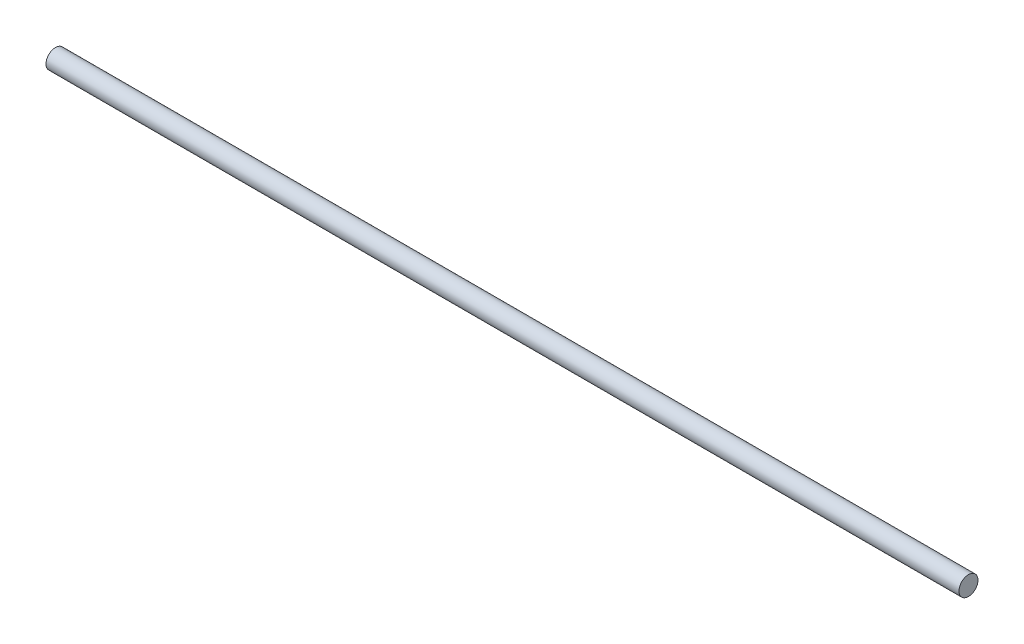
ISO-10303-21;
HEADER;
FILE_DESCRIPTION(('STEP AP214'),'2;1');
FILE_NAME('part.step','',(''),(''),'','','');
FILE_SCHEMA(('AUTOMOTIVE_DESIGN { 1 0 10303 214 1 1 1 1 }'));
ENDSEC;
DATA;
#1=APPLICATION_CONTEXT('core data for automotive mechanical design processes');
#2=APPLICATION_PROTOCOL_DEFINITION('international standard','automotive_design',2000,#1);
#3=PRODUCT_CONTEXT('',#1,'mechanical');
#4=PRODUCT('Part','Part','',(#3));
#5=PRODUCT_RELATED_PRODUCT_CATEGORY('part','',(#4));
#6=PRODUCT_DEFINITION_FORMATION('','',#4);
#7=PRODUCT_DEFINITION_CONTEXT('part definition',#1,'design');
#8=PRODUCT_DEFINITION('design','',#6,#7);
#9=PRODUCT_DEFINITION_SHAPE('','',#8);
#10=(LENGTH_UNIT() NAMED_UNIT(*) SI_UNIT(.MILLI.,.METRE.));
#11=(NAMED_UNIT(*) PLANE_ANGLE_UNIT() SI_UNIT($,.RADIAN.));
#12=(NAMED_UNIT(*) SI_UNIT($,.STERADIAN.) SOLID_ANGLE_UNIT());
#13=UNCERTAINTY_MEASURE_WITH_UNIT(LENGTH_MEASURE(1.E-05),#10,'distance_accuracy_value','');
#14=(GEOMETRIC_REPRESENTATION_CONTEXT(3) GLOBAL_UNCERTAINTY_ASSIGNED_CONTEXT((#13)) GLOBAL_UNIT_ASSIGNED_CONTEXT((#10,
#11,#12)) REPRESENTATION_CONTEXT('',''));
#15=CARTESIAN_POINT('',(0.,0.,0.));
#16=DIRECTION('',(0.,0.,1.));
#17=DIRECTION('',(1.,0.,0.));
#18=AXIS2_PLACEMENT_3D('',#15,#16,#17);
#19=CARTESIAN_POINT('',(240.,0.,0.));
#20=DIRECTION('',(-1.,0.,0.));
#21=DIRECTION('',(0.,0.,1.));
#22=AXIS2_PLACEMENT_3D('',#19,#20,#21);
#23=CYLINDRICAL_SURFACE('',#22,5.);
#24=CARTESIAN_POINT('',(240.,0.,0.));
#25=DIRECTION('',(1.,0.,0.));
#26=DIRECTION('',(0.,0.,-1.));
#27=AXIS2_PLACEMENT_3D('',#24,#25,#26);
#28=CIRCLE('',#27,5.);
#29=CARTESIAN_POINT('',(240.,0.,-5.));
#30=VERTEX_POINT('',#29);
#31=EDGE_CURVE('E12',#30,#30,#28,.T.);
#32=ORIENTED_EDGE('',*,*,#31,.F.);
#33=EDGE_LOOP('',(#32));
#34=FACE_BOUND('',#33,.T.);
#35=CARTESIAN_POINT('',(-240.,0.,0.));
#36=DIRECTION('',(1.,0.,0.));
#37=DIRECTION('',(0.,0.,-1.));
#38=AXIS2_PLACEMENT_3D('',#35,#36,#37);
#39=CIRCLE('',#38,5.);
#40=CARTESIAN_POINT('',(-240.,0.,-5.));
#41=VERTEX_POINT('',#40);
#42=EDGE_CURVE('E41',#41,#41,#39,.T.);
#43=ORIENTED_EDGE('',*,*,#42,.T.);
#44=EDGE_LOOP('',(#43));
#45=FACE_BOUND('',#44,.T.);
#46=ADVANCED_FACE('F38',(#34,#45),#23,.T.);
#47=CARTESIAN_POINT('',(240.,0.,0.));
#48=DIRECTION('',(1.,0.,0.));
#49=DIRECTION('',(0.,0.,-1.));
#50=AXIS2_PLACEMENT_3D('',#47,#48,#49);
#51=PLANE('',#50);
#52=ORIENTED_EDGE('',*,*,#31,.T.);
#53=EDGE_LOOP('',(#52));
#54=FACE_BOUND('',#53,.T.);
#55=ADVANCED_FACE('F53',(#54),#51,.T.);
#56=CARTESIAN_POINT('',(-240.,0.,0.));
#57=DIRECTION('',(1.,0.,0.));
#58=DIRECTION('',(0.,0.,-1.));
#59=AXIS2_PLACEMENT_3D('',#56,#57,#58);
#60=PLANE('',#59);
#61=ORIENTED_EDGE('',*,*,#42,.F.);
#62=EDGE_LOOP('',(#61));
#63=FACE_BOUND('',#62,.T.);
#64=ADVANCED_FACE('F51',(#63),#60,.F.);
#65=CLOSED_SHELL('',(#46,#55,#64));
#66=MANIFOLD_SOLID_BREP('B2',#65);
#67=ADVANCED_BREP_SHAPE_REPRESENTATION('',(#18,#66),#14);
#68=SHAPE_DEFINITION_REPRESENTATION(#9,#67);
ENDSEC;
END-ISO-10303-21;
